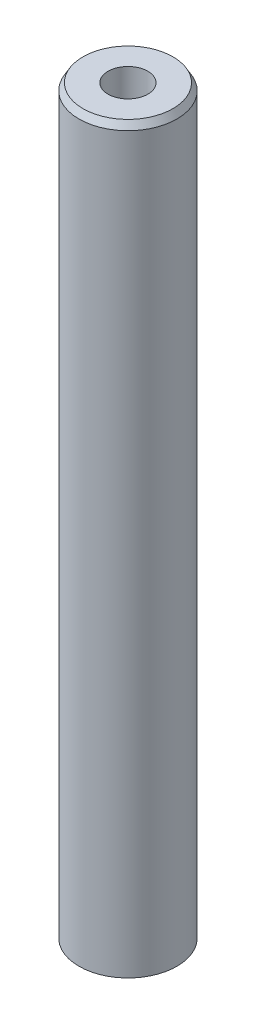
ISO-10303-21;
HEADER;
FILE_DESCRIPTION(('STEP AP214'),'2;1');
FILE_NAME('part.step','',(''),(''),'','','');
FILE_SCHEMA(('AUTOMOTIVE_DESIGN { 1 0 10303 214 1 1 1 1 }'));
ENDSEC;
DATA;
#1=APPLICATION_CONTEXT('core data for automotive mechanical design processes');
#2=APPLICATION_PROTOCOL_DEFINITION('international standard','automotive_design',2000,#1);
#3=PRODUCT_CONTEXT('',#1,'mechanical');
#4=PRODUCT('Part','Part','',(#3));
#5=PRODUCT_RELATED_PRODUCT_CATEGORY('part','',(#4));
#6=PRODUCT_DEFINITION_FORMATION('','',#4);
#7=PRODUCT_DEFINITION_CONTEXT('part definition',#1,'design');
#8=PRODUCT_DEFINITION('design','',#6,#7);
#9=PRODUCT_DEFINITION_SHAPE('','',#8);
#10=(LENGTH_UNIT() NAMED_UNIT(*) SI_UNIT(.MILLI.,.METRE.));
#11=(NAMED_UNIT(*) PLANE_ANGLE_UNIT() SI_UNIT($,.RADIAN.));
#12=(NAMED_UNIT(*) SI_UNIT($,.STERADIAN.) SOLID_ANGLE_UNIT());
#13=UNCERTAINTY_MEASURE_WITH_UNIT(LENGTH_MEASURE(1.E-05),#10,'distance_accuracy_value','');
#14=(GEOMETRIC_REPRESENTATION_CONTEXT(3) GLOBAL_UNCERTAINTY_ASSIGNED_CONTEXT((#13)) GLOBAL_UNIT_ASSIGNED_CONTEXT((#10,
#11,#12)) REPRESENTATION_CONTEXT('',''));
#15=CARTESIAN_POINT('',(0.,0.,0.));
#16=DIRECTION('',(0.,0.,1.));
#17=DIRECTION('',(1.,0.,0.));
#18=AXIS2_PLACEMENT_3D('',#15,#16,#17);
#19=CARTESIAN_POINT('',(0.,114.046185371661,0.));
#20=DIRECTION('',(0.,-1.,0.));
#21=DIRECTION('',(0.,0.,-1.));
#22=AXIS2_PLACEMENT_3D('',#19,#20,#21);
#23=CYLINDRICAL_SURFACE('',#22,7.5);
#24=CARTESIAN_POINT('',(0.,112.980323765133,0.));
#25=DIRECTION('',(0.,1.,0.));
#26=DIRECTION('',(0.,0.,1.));
#27=AXIS2_PLACEMENT_3D('',#24,#25,#26);
#28=CIRCLE('',#27,7.5);
#29=CARTESIAN_POINT('',(0.,112.980323765133,7.5));
#30=VERTEX_POINT('',#29);
#31=EDGE_CURVE('E50',#30,#30,#28,.F.);
#32=ORIENTED_EDGE('',*,*,#31,.T.);
#33=EDGE_LOOP('',(#32));
#34=FACE_BOUND('',#33,.T.);
#35=CARTESIAN_POINT('',(0.,0.615375485447725,0.));
#36=DIRECTION('',(0.,1.,0.));
#37=DIRECTION('',(0.,0.,1.));
#38=AXIS2_PLACEMENT_3D('',#35,#36,#37);
#39=CIRCLE('',#38,7.5);
#40=CARTESIAN_POINT('',(0.,0.615375485447725,7.5));
#41=VERTEX_POINT('',#40);
#42=EDGE_CURVE('E51',#41,#41,#39,.T.);
#43=ORIENTED_EDGE('',*,*,#42,.T.);
#44=EDGE_LOOP('',(#43));
#45=FACE_BOUND('',#44,.T.);
#46=ADVANCED_FACE('F39',(#34,#45),#23,.T.);
#47=CARTESIAN_POINT('',(0.,114.046185371661,0.));
#48=DIRECTION('',(0.,1.,0.));
#49=DIRECTION('',(0.,0.,1.));
#50=AXIS2_PLACEMENT_3D('',#47,#48,#49);
#51=PLANE('',#50);
#52=CARTESIAN_POINT('',(0.,114.046185371661,0.));
#53=DIRECTION('',(0.,1.,0.));
#54=DIRECTION('',(0.,0.,1.));
#55=AXIS2_PLACEMENT_3D('',#52,#53,#54);
#56=CIRCLE('',#55,6.88462451455228);
#57=CARTESIAN_POINT('',(0.,114.046185371661,6.88462451455228));
#58=VERTEX_POINT('',#57);
#59=EDGE_CURVE('E54',#58,#58,#56,.T.);
#60=ORIENTED_EDGE('',*,*,#59,.T.);
#61=EDGE_LOOP('',(#60));
#62=FACE_BOUND('',#61,.T.);
#63=CARTESIAN_POINT('',(0.,114.046185371661,0.));
#64=DIRECTION('',(0.,1.,0.));
#65=DIRECTION('',(0.,0.,1.));
#66=AXIS2_PLACEMENT_3D('',#63,#64,#65);
#67=CIRCLE('',#66,3.04820136976946);
#68=CARTESIAN_POINT('',(0.,114.046185371661,3.04820136976946));
#69=VERTEX_POINT('',#68);
#70=EDGE_CURVE('E58',#69,#69,#67,.T.);
#71=ORIENTED_EDGE('',*,*,#70,.F.);
#72=EDGE_LOOP('',(#71));
#73=FACE_BOUND('',#72,.T.);
#74=ADVANCED_FACE('F69',(#62,#73),#51,.T.);
#75=CARTESIAN_POINT('',(0.,0.,0.));
#76=DIRECTION('',(0.,1.,0.));
#77=DIRECTION('',(0.,0.,1.));
#78=AXIS2_PLACEMENT_3D('',#75,#76,#77);
#79=PLANE('',#78);
#80=CARTESIAN_POINT('',(0.,0.,0.));
#81=DIRECTION('',(0.,1.,0.));
#82=DIRECTION('',(0.,0.,1.));
#83=AXIS2_PLACEMENT_3D('',#80,#81,#82);
#84=CIRCLE('',#83,6.43413839347216);
#85=CARTESIAN_POINT('',(0.,0.,6.43413839347216));
#86=VERTEX_POINT('',#85);
#87=EDGE_CURVE('E10',#86,#86,#84,.F.);
#88=ORIENTED_EDGE('',*,*,#87,.T.);
#89=EDGE_LOOP('',(#88));
#90=FACE_BOUND('',#89,.T.);
#91=CARTESIAN_POINT('',(0.,0.,0.));
#92=DIRECTION('',(0.,1.,0.));
#93=DIRECTION('',(0.,0.,1.));
#94=AXIS2_PLACEMENT_3D('',#91,#92,#93);
#95=CIRCLE('',#94,3.04820136976946);
#96=CARTESIAN_POINT('',(0.,0.,3.04820136976946));
#97=VERTEX_POINT('',#96);
#98=EDGE_CURVE('E63',#97,#97,#95,.T.);
#99=ORIENTED_EDGE('',*,*,#98,.T.);
#100=EDGE_LOOP('',(#99));
#101=FACE_BOUND('',#100,.T.);
#102=ADVANCED_FACE('F75',(#90,#101),#79,.F.);
#103=CARTESIAN_POINT('',(0.,114.046185371661,0.));
#104=DIRECTION('',(0.,-1.,0.));
#105=DIRECTION('',(0.,0.,-1.));
#106=AXIS2_PLACEMENT_3D('',#103,#104,#105);
#107=CYLINDRICAL_SURFACE('',#106,3.04820136976946);
#108=ORIENTED_EDGE('',*,*,#70,.T.);
#109=EDGE_LOOP('',(#108));
#110=FACE_BOUND('',#109,.T.);
#111=ORIENTED_EDGE('',*,*,#98,.F.);
#112=EDGE_LOOP('',(#111));
#113=FACE_BOUND('',#112,.T.);
#114=ADVANCED_FACE('F70',(#110,#113),#107,.F.);
#115=CARTESIAN_POINT('',(0.,114.046185371661,0.));
#116=DIRECTION('',(0.,-1.,0.));
#117=DIRECTION('',(0.,0.,-1.));
#118=AXIS2_PLACEMENT_3D('',#115,#116,#117);
#119=CONICAL_SURFACE('',#118,6.88462451455228,0.52359877559829);
#120=ORIENTED_EDGE('',*,*,#31,.F.);
#121=EDGE_LOOP('',(#120));
#122=FACE_BOUND('',#121,.T.);
#123=ORIENTED_EDGE('',*,*,#59,.F.);
#124=EDGE_LOOP('',(#123));
#125=FACE_BOUND('',#124,.T.);
#126=ADVANCED_FACE('F81',(#122,#125),#119,.T.);
#127=CARTESIAN_POINT('',(0.,0.615375485447725,0.));
#128=DIRECTION('',(0.,1.,0.));
#129=DIRECTION('',(0.,0.,1.));
#130=AXIS2_PLACEMENT_3D('',#127,#128,#129);
#131=CONICAL_SURFACE('',#130,7.5,1.0471975511966);
#132=ORIENTED_EDGE('',*,*,#87,.F.);
#133=EDGE_LOOP('',(#132));
#134=FACE_BOUND('',#133,.T.);
#135=ORIENTED_EDGE('',*,*,#42,.F.);
#136=EDGE_LOOP('',(#135));
#137=FACE_BOUND('',#136,.T.);
#138=ADVANCED_FACE('F45',(#134,#137),#131,.T.);
#139=CLOSED_SHELL('',(#46,#74,#102,#114,#126,#138));
#140=MANIFOLD_SOLID_BREP('B2',#139);
#141=ADVANCED_BREP_SHAPE_REPRESENTATION('',(#18,#140),#14);
#142=SHAPE_DEFINITION_REPRESENTATION(#9,#141);
ENDSEC;
END-ISO-10303-21;
